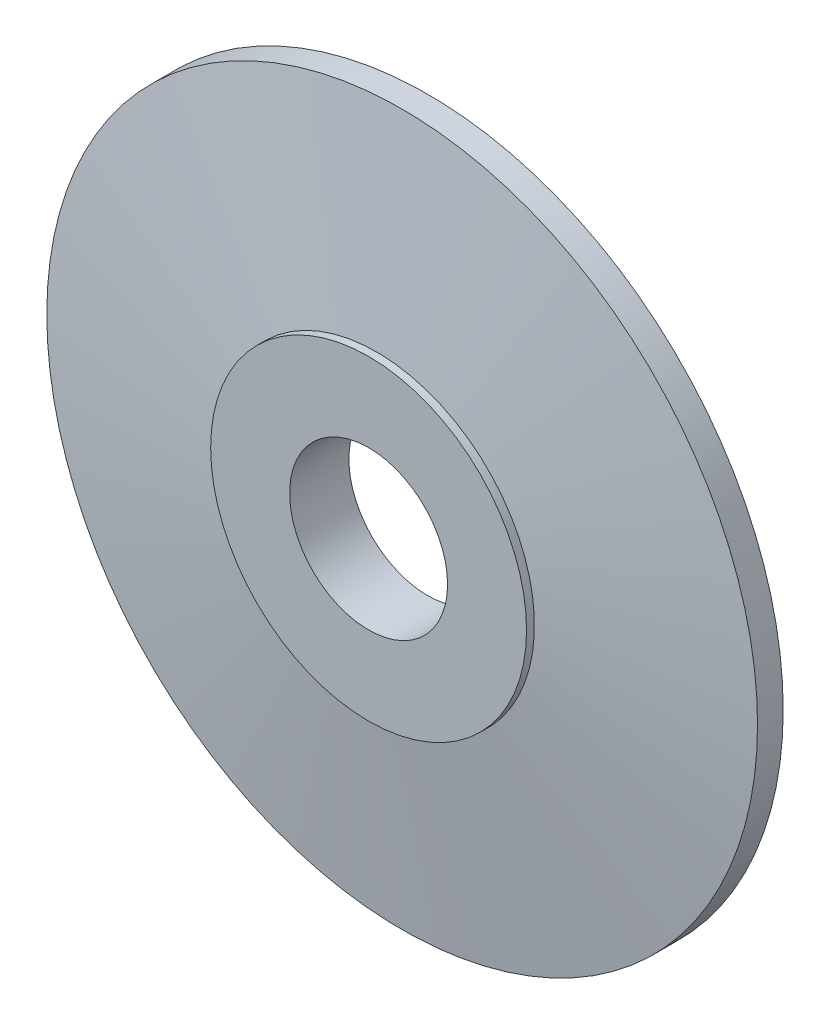
ISO-10303-21;
HEADER;
FILE_DESCRIPTION(('STEP AP214'),'2;1');
FILE_NAME('part.step','',(''),(''),'','','');
FILE_SCHEMA(('AUTOMOTIVE_DESIGN { 1 0 10303 214 1 1 1 1 }'));
ENDSEC;
DATA;
#1=APPLICATION_CONTEXT('core data for automotive mechanical design processes');
#2=APPLICATION_PROTOCOL_DEFINITION('international standard','automotive_design',2000,#1);
#3=PRODUCT_CONTEXT('',#1,'mechanical');
#4=PRODUCT('Part','Part','',(#3));
#5=PRODUCT_RELATED_PRODUCT_CATEGORY('part','',(#4));
#6=PRODUCT_DEFINITION_FORMATION('','',#4);
#7=PRODUCT_DEFINITION_CONTEXT('part definition',#1,'design');
#8=PRODUCT_DEFINITION('design','',#6,#7);
#9=PRODUCT_DEFINITION_SHAPE('','',#8);
#10=(LENGTH_UNIT() NAMED_UNIT(*) SI_UNIT(.MILLI.,.METRE.));
#11=(NAMED_UNIT(*) PLANE_ANGLE_UNIT() SI_UNIT($,.RADIAN.));
#12=(NAMED_UNIT(*) SI_UNIT($,.STERADIAN.) SOLID_ANGLE_UNIT());
#13=UNCERTAINTY_MEASURE_WITH_UNIT(LENGTH_MEASURE(1.E-05),#10,'distance_accuracy_value','');
#14=(GEOMETRIC_REPRESENTATION_CONTEXT(3) GLOBAL_UNCERTAINTY_ASSIGNED_CONTEXT((#13)) GLOBAL_UNIT_ASSIGNED_CONTEXT((#10,
#11,#12)) REPRESENTATION_CONTEXT('',''));
#15=CARTESIAN_POINT('',(0.,0.,0.));
#16=DIRECTION('',(0.,0.,1.));
#17=DIRECTION('',(1.,0.,0.));
#18=AXIS2_PLACEMENT_3D('',#15,#16,#17);
#19=CARTESIAN_POINT('',(0.,0.,0.));
#20=DIRECTION('',(0.,0.,1.));
#21=DIRECTION('',(1.,0.,0.));
#22=AXIS2_PLACEMENT_3D('',#19,#20,#21);
#23=PLANE('',#22);
#24=CARTESIAN_POINT('',(0.,0.,0.));
#25=DIRECTION('',(0.,0.,1.));
#26=DIRECTION('',(1.,0.,0.));
#27=AXIS2_PLACEMENT_3D('',#24,#25,#26);
#28=CIRCLE('',#27,9.);
#29=CARTESIAN_POINT('',(9.,0.,0.));
#30=VERTEX_POINT('',#29);
#31=EDGE_CURVE('E10',#30,#30,#28,.T.);
#32=ORIENTED_EDGE('',*,*,#31,.F.);
#33=EDGE_LOOP('',(#32));
#34=FACE_BOUND('',#33,.T.);
#35=CARTESIAN_POINT('',(0.,0.,0.));
#36=DIRECTION('',(0.,0.,1.));
#37=DIRECTION('',(1.,0.,0.));
#38=AXIS2_PLACEMENT_3D('',#35,#36,#37);
#39=CIRCLE('',#38,2.);
#40=CARTESIAN_POINT('',(2.,0.,0.));
#41=VERTEX_POINT('',#40);
#42=EDGE_CURVE('E40',#41,#41,#39,.T.);
#43=ORIENTED_EDGE('',*,*,#42,.T.);
#44=EDGE_LOOP('',(#43));
#45=FACE_BOUND('',#44,.T.);
#46=ADVANCED_FACE('F33',(#34,#45),#23,.F.);
#47=CARTESIAN_POINT('',(0.,0.,1.3));
#48=DIRECTION('',(0.,0.,-1.));
#49=DIRECTION('',(-1.,0.,0.));
#50=AXIS2_PLACEMENT_3D('',#47,#48,#49);
#51=CYLINDRICAL_SURFACE('',#50,9.);
#52=CARTESIAN_POINT('',(0.,0.,0.65));
#53=DIRECTION('',(0.,0.,-1.));
#54=DIRECTION('',(-1.,0.,0.));
#55=AXIS2_PLACEMENT_3D('',#52,#53,#54);
#56=CIRCLE('',#55,9.);
#57=CARTESIAN_POINT('',(-9.,0.,0.65));
#58=VERTEX_POINT('',#57);
#59=EDGE_CURVE('E53',#58,#58,#56,.T.);
#60=ORIENTED_EDGE('',*,*,#59,.T.);
#61=EDGE_LOOP('',(#60));
#62=FACE_BOUND('',#61,.T.);
#63=ORIENTED_EDGE('',*,*,#31,.T.);
#64=EDGE_LOOP('',(#63));
#65=FACE_BOUND('',#64,.T.);
#66=ADVANCED_FACE('F35',(#62,#65),#51,.T.);
#67=CARTESIAN_POINT('',(0.,0.,1.3));
#68=DIRECTION('',(0.,0.,-1.));
#69=DIRECTION('',(-1.,0.,0.));
#70=AXIS2_PLACEMENT_3D('',#67,#68,#69);
#71=CYLINDRICAL_SURFACE('',#70,2.);
#72=ORIENTED_EDGE('',*,*,#42,.F.);
#73=EDGE_LOOP('',(#72));
#74=FACE_BOUND('',#73,.T.);
#75=CARTESIAN_POINT('',(0.,0.,1.5));
#76=DIRECTION('',(0.,0.,1.));
#77=DIRECTION('',(1.,0.,0.));
#78=AXIS2_PLACEMENT_3D('',#75,#76,#77);
#79=CIRCLE('',#78,2.);
#80=CARTESIAN_POINT('',(2.,0.,1.5));
#81=VERTEX_POINT('',#80);
#82=EDGE_CURVE('E48',#81,#81,#79,.T.);
#83=ORIENTED_EDGE('',*,*,#82,.T.);
#84=EDGE_LOOP('',(#83));
#85=FACE_BOUND('',#84,.T.);
#86=ADVANCED_FACE('F73',(#74,#85),#71,.F.);
#87=CARTESIAN_POINT('',(0.,0.,1.5));
#88=DIRECTION('',(0.,0.,1.));
#89=DIRECTION('',(1.,0.,0.));
#90=AXIS2_PLACEMENT_3D('',#87,#88,#89);
#91=PLANE('',#90);
#92=CARTESIAN_POINT('',(0.,0.,1.5));
#93=DIRECTION('',(0.,0.,1.));
#94=DIRECTION('',(1.,0.,0.));
#95=AXIS2_PLACEMENT_3D('',#92,#93,#94);
#96=CIRCLE('',#95,4.);
#97=CARTESIAN_POINT('',(4.,0.,1.5));
#98=VERTEX_POINT('',#97);
#99=EDGE_CURVE('E44',#98,#98,#96,.T.);
#100=ORIENTED_EDGE('',*,*,#99,.T.);
#101=EDGE_LOOP('',(#100));
#102=FACE_BOUND('',#101,.T.);
#103=ORIENTED_EDGE('',*,*,#82,.F.);
#104=EDGE_LOOP('',(#103));
#105=FACE_BOUND('',#104,.T.);
#106=ADVANCED_FACE('F64',(#102,#105),#91,.T.);
#107=CARTESIAN_POINT('',(0.,0.,1.5));
#108=DIRECTION('',(0.,0.,-1.));
#109=DIRECTION('',(-1.,0.,0.));
#110=AXIS2_PLACEMENT_3D('',#107,#108,#109);
#111=CYLINDRICAL_SURFACE('',#110,4.);
#112=ORIENTED_EDGE('',*,*,#99,.F.);
#113=EDGE_LOOP('',(#112));
#114=FACE_BOUND('',#113,.T.);
#115=CARTESIAN_POINT('',(0.,0.,1.3));
#116=DIRECTION('',(0.,0.,-1.));
#117=DIRECTION('',(-1.,0.,0.));
#118=AXIS2_PLACEMENT_3D('',#115,#116,#117);
#119=CIRCLE('',#118,4.);
#120=CARTESIAN_POINT('',(-4.,0.,1.3));
#121=VERTEX_POINT('',#120);
#122=EDGE_CURVE('E56',#121,#121,#119,.T.);
#123=ORIENTED_EDGE('',*,*,#122,.F.);
#124=EDGE_LOOP('',(#123));
#125=FACE_BOUND('',#124,.T.);
#126=ADVANCED_FACE('F62',(#114,#125),#111,.T.);
#127=CARTESIAN_POINT('',(0.,0.,1.3));
#128=DIRECTION('',(0.,0.,-1.));
#129=DIRECTION('',(-1.,0.,0.));
#130=AXIS2_PLACEMENT_3D('',#127,#128,#129);
#131=CONICAL_SURFACE('',#130,4.,1.44152132274675);
#132=ORIENTED_EDGE('',*,*,#59,.F.);
#133=EDGE_LOOP('',(#132));
#134=FACE_BOUND('',#133,.T.);
#135=ORIENTED_EDGE('',*,*,#122,.T.);
#136=EDGE_LOOP('',(#135));
#137=FACE_BOUND('',#136,.T.);
#138=ADVANCED_FACE('F60',(#134,#137),#131,.T.);
#139=CLOSED_SHELL('',(#46,#66,#86,#106,#126,#138));
#140=MANIFOLD_SOLID_BREP('B2',#139);
#141=ADVANCED_BREP_SHAPE_REPRESENTATION('',(#18,#140),#14);
#142=SHAPE_DEFINITION_REPRESENTATION(#9,#141);
ENDSEC;
END-ISO-10303-21;
